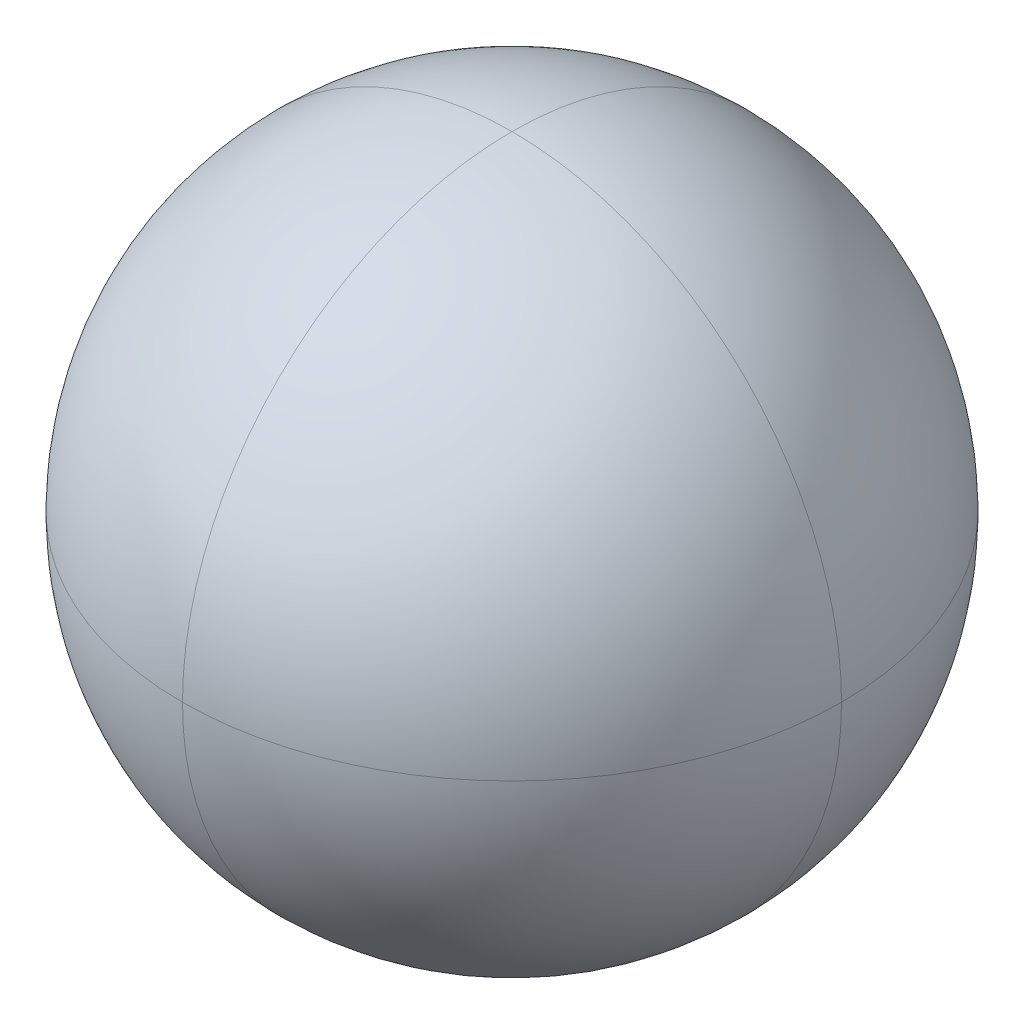
ISO-10303-21;
HEADER;
FILE_DESCRIPTION(('STEP AP214'),'2;1');
FILE_NAME('part.step','',(''),(''),'','','');
FILE_SCHEMA(('AUTOMOTIVE_DESIGN { 1 0 10303 214 1 1 1 1 }'));
ENDSEC;
DATA;
#1=APPLICATION_CONTEXT('core data for automotive mechanical design processes');
#2=APPLICATION_PROTOCOL_DEFINITION('international standard','automotive_design',2000,#1);
#3=PRODUCT_CONTEXT('',#1,'mechanical');
#4=PRODUCT('Part','Part','',(#3));
#5=PRODUCT_RELATED_PRODUCT_CATEGORY('part','',(#4));
#6=PRODUCT_DEFINITION_FORMATION('','',#4);
#7=PRODUCT_DEFINITION_CONTEXT('part definition',#1,'design');
#8=PRODUCT_DEFINITION('design','',#6,#7);
#9=PRODUCT_DEFINITION_SHAPE('','',#8);
#10=(LENGTH_UNIT() NAMED_UNIT(*) SI_UNIT(.MILLI.,.METRE.));
#11=(NAMED_UNIT(*) PLANE_ANGLE_UNIT() SI_UNIT($,.RADIAN.));
#12=(NAMED_UNIT(*) SI_UNIT($,.STERADIAN.) SOLID_ANGLE_UNIT());
#13=UNCERTAINTY_MEASURE_WITH_UNIT(LENGTH_MEASURE(1.E-05),#10,'distance_accuracy_value','');
#14=(GEOMETRIC_REPRESENTATION_CONTEXT(3) GLOBAL_UNCERTAINTY_ASSIGNED_CONTEXT((#13)) GLOBAL_UNIT_ASSIGNED_CONTEXT((#10,
#11,#12)) REPRESENTATION_CONTEXT('',''));
#15=CARTESIAN_POINT('',(0.,0.,0.));
#16=DIRECTION('',(0.,0.,1.));
#17=DIRECTION('',(1.,0.,0.));
#18=AXIS2_PLACEMENT_3D('',#15,#16,#17);
#19=CARTESIAN_POINT('',(0.,20.,0.));
#20=DIRECTION('',(1.,0.,0.));
#21=DIRECTION('',(0.,0.,-1.));
#22=AXIS2_PLACEMENT_3D('',#19,#20,#21);
#23=SPHERICAL_SURFACE('',#22,20.);
#24=CARTESIAN_POINT('',(0.,20.,0.));
#25=DIRECTION('',(1.,0.,0.));
#26=DIRECTION('',(0.,0.,-1.));
#27=AXIS2_PLACEMENT_3D('',#24,#25,#26);
#28=CIRCLE('',#27,20.);
#29=CARTESIAN_POINT('',(0.,20.,20.));
#30=VERTEX_POINT('',#29);
#31=CARTESIAN_POINT('',(0.,40.,0.));
#32=VERTEX_POINT('',#31);
#33=EDGE_CURVE('E90',#30,#32,#28,.F.);
#34=ORIENTED_EDGE('',*,*,#33,.F.);
#35=CARTESIAN_POINT('',(0.,20.,0.));
#36=DIRECTION('',(0.,-1.,0.));
#37=DIRECTION('',(0.,0.,-1.));
#38=AXIS2_PLACEMENT_3D('',#35,#36,#37);
#39=CIRCLE('',#38,20.);
#40=CARTESIAN_POINT('',(20.,20.,0.));
#41=VERTEX_POINT('',#40);
#42=EDGE_CURVE('E11',#41,#30,#39,.T.);
#43=ORIENTED_EDGE('',*,*,#42,.F.);
#44=CARTESIAN_POINT('',(0.,20.,0.));
#45=DIRECTION('',(0.,0.,1.));
#46=DIRECTION('',(1.,0.,0.));
#47=AXIS2_PLACEMENT_3D('',#44,#45,#46);
#48=CIRCLE('',#47,20.);
#49=EDGE_CURVE('E51',#32,#41,#48,.F.);
#50=ORIENTED_EDGE('',*,*,#49,.F.);
#51=EDGE_LOOP('',(#34,#43,#50));
#52=FACE_BOUND('',#51,.T.);
#53=ADVANCED_FACE('F43',(#52),#23,.T.);
#54=CARTESIAN_POINT('',(0.,20.,0.));
#55=DIRECTION('',(0.,0.,1.));
#56=DIRECTION('',(1.,0.,0.));
#57=AXIS2_PLACEMENT_3D('',#54,#55,#56);
#58=SPHERICAL_SURFACE('',#57,20.);
#59=CARTESIAN_POINT('',(0.,20.,0.));
#60=DIRECTION('',(0.,0.,1.));
#61=DIRECTION('',(1.,0.,0.));
#62=AXIS2_PLACEMENT_3D('',#59,#60,#61);
#63=CIRCLE('',#62,20.);
#64=CARTESIAN_POINT('',(0.,0.,0.));
#65=VERTEX_POINT('',#64);
#66=EDGE_CURVE('E84',#41,#65,#63,.F.);
#67=ORIENTED_EDGE('',*,*,#66,.F.);
#68=ORIENTED_EDGE('',*,*,#42,.T.);
#69=CARTESIAN_POINT('',(0.,20.,0.));
#70=DIRECTION('',(1.,0.,0.));
#71=DIRECTION('',(0.,0.,-1.));
#72=AXIS2_PLACEMENT_3D('',#69,#70,#71);
#73=CIRCLE('',#72,20.);
#74=EDGE_CURVE('E80',#65,#30,#73,.F.);
#75=ORIENTED_EDGE('',*,*,#74,.F.);
#76=EDGE_LOOP('',(#67,#68,#75));
#77=FACE_BOUND('',#76,.T.);
#78=ADVANCED_FACE('F128',(#77),#58,.T.);
#79=CARTESIAN_POINT('',(0.,20.,0.));
#80=DIRECTION('',(1.,0.,0.));
#81=DIRECTION('',(0.,0.,-1.));
#82=AXIS2_PLACEMENT_3D('',#79,#80,#81);
#83=SPHERICAL_SURFACE('',#82,20.);
#84=ORIENTED_EDGE('',*,*,#49,.T.);
#85=CARTESIAN_POINT('',(0.,20.,0.));
#86=DIRECTION('',(0.,-1.,0.));
#87=DIRECTION('',(0.,0.,-1.));
#88=AXIS2_PLACEMENT_3D('',#85,#86,#87);
#89=CIRCLE('',#88,20.);
#90=CARTESIAN_POINT('',(0.,20.,-20.));
#91=VERTEX_POINT('',#90);
#92=EDGE_CURVE('E85',#91,#41,#89,.T.);
#93=ORIENTED_EDGE('',*,*,#92,.F.);
#94=CARTESIAN_POINT('',(0.,20.,0.));
#95=DIRECTION('',(1.,0.,0.));
#96=DIRECTION('',(0.,0.,-1.));
#97=AXIS2_PLACEMENT_3D('',#94,#95,#96);
#98=CIRCLE('',#97,20.);
#99=EDGE_CURVE('E96',#32,#91,#98,.F.);
#100=ORIENTED_EDGE('',*,*,#99,.F.);
#101=EDGE_LOOP('',(#84,#93,#100));
#102=FACE_BOUND('',#101,.T.);
#103=ADVANCED_FACE('F126',(#102),#83,.T.);
#104=CARTESIAN_POINT('',(0.,20.,0.));
#105=DIRECTION('',(0.,0.,1.));
#106=DIRECTION('',(1.,0.,0.));
#107=AXIS2_PLACEMENT_3D('',#104,#105,#106);
#108=SPHERICAL_SURFACE('',#107,20.);
#109=CARTESIAN_POINT('',(0.,20.,0.));
#110=DIRECTION('',(0.,1.,0.));
#111=DIRECTION('',(0.,0.,1.));
#112=AXIS2_PLACEMENT_3D('',#109,#110,#111);
#113=CIRCLE('',#112,20.);
#114=CARTESIAN_POINT('',(-20.,20.,0.));
#115=VERTEX_POINT('',#114);
#116=EDGE_CURVE('E74',#115,#30,#113,.T.);
#117=ORIENTED_EDGE('',*,*,#116,.T.);
#118=ORIENTED_EDGE('',*,*,#33,.T.);
#119=CARTESIAN_POINT('',(0.,20.,0.));
#120=DIRECTION('',(0.,0.,1.));
#121=DIRECTION('',(1.,0.,0.));
#122=AXIS2_PLACEMENT_3D('',#119,#120,#121);
#123=CIRCLE('',#122,20.);
#124=EDGE_CURVE('E88',#115,#32,#123,.F.);
#125=ORIENTED_EDGE('',*,*,#124,.F.);
#126=EDGE_LOOP('',(#117,#118,#125));
#127=FACE_BOUND('',#126,.T.);
#128=ADVANCED_FACE('F89',(#127),#108,.T.);
#129=CARTESIAN_POINT('',(0.,20.,0.));
#130=DIRECTION('',(0.,0.,1.));
#131=DIRECTION('',(1.,0.,0.));
#132=AXIS2_PLACEMENT_3D('',#129,#130,#131);
#133=SPHERICAL_SURFACE('',#132,20.);
#134=ORIENTED_EDGE('',*,*,#74,.T.);
#135=ORIENTED_EDGE('',*,*,#116,.F.);
#136=CARTESIAN_POINT('',(0.,20.,0.));
#137=DIRECTION('',(0.,0.,1.));
#138=DIRECTION('',(1.,0.,0.));
#139=AXIS2_PLACEMENT_3D('',#136,#137,#138);
#140=CIRCLE('',#139,20.);
#141=EDGE_CURVE('E78',#65,#115,#140,.F.);
#142=ORIENTED_EDGE('',*,*,#141,.F.);
#143=EDGE_LOOP('',(#134,#135,#142));
#144=FACE_BOUND('',#143,.T.);
#145=ADVANCED_FACE('F76',(#144),#133,.T.);
#146=CARTESIAN_POINT('',(0.,20.,0.));
#147=DIRECTION('',(1.,0.,0.));
#148=DIRECTION('',(0.,0.,-1.));
#149=AXIS2_PLACEMENT_3D('',#146,#147,#148);
#150=SPHERICAL_SURFACE('',#149,20.);
#151=ORIENTED_EDGE('',*,*,#92,.T.);
#152=ORIENTED_EDGE('',*,*,#66,.T.);
#153=CARTESIAN_POINT('',(0.,20.,0.));
#154=DIRECTION('',(1.,0.,0.));
#155=DIRECTION('',(0.,0.,-1.));
#156=AXIS2_PLACEMENT_3D('',#153,#154,#155);
#157=CIRCLE('',#156,20.);
#158=EDGE_CURVE('E103',#91,#65,#157,.F.);
#159=ORIENTED_EDGE('',*,*,#158,.F.);
#160=EDGE_LOOP('',(#151,#152,#159));
#161=FACE_BOUND('',#160,.T.);
#162=ADVANCED_FACE('F141',(#161),#150,.T.);
#163=CARTESIAN_POINT('',(0.,20.,0.));
#164=DIRECTION('',(0.,1.,0.));
#165=DIRECTION('',(-1.,0.,0.));
#166=AXIS2_PLACEMENT_3D('',#163,#164,#165);
#167=SPHERICAL_SURFACE('',#166,20.);
#168=ORIENTED_EDGE('',*,*,#124,.T.);
#169=ORIENTED_EDGE('',*,*,#99,.T.);
#170=CARTESIAN_POINT('',(0.,20.,0.));
#171=DIRECTION('',(0.,1.,0.));
#172=DIRECTION('',(0.,0.,1.));
#173=AXIS2_PLACEMENT_3D('',#170,#171,#172);
#174=CIRCLE('',#173,20.);
#175=EDGE_CURVE('E101',#115,#91,#174,.F.);
#176=ORIENTED_EDGE('',*,*,#175,.F.);
#177=EDGE_LOOP('',(#168,#169,#176));
#178=FACE_BOUND('',#177,.T.);
#179=ADVANCED_FACE('F106',(#178),#167,.T.);
#180=CARTESIAN_POINT('',(0.,20.,0.));
#181=DIRECTION('',(0.,-1.,0.));
#182=DIRECTION('',(0.,0.,-1.));
#183=AXIS2_PLACEMENT_3D('',#180,#181,#182);
#184=SPHERICAL_SURFACE('',#183,20.);
#185=ORIENTED_EDGE('',*,*,#158,.T.);
#186=ORIENTED_EDGE('',*,*,#141,.T.);
#187=ORIENTED_EDGE('',*,*,#175,.T.);
#188=EDGE_LOOP('',(#185,#186,#187));
#189=FACE_BOUND('',#188,.T.);
#190=ADVANCED_FACE('F100',(#189),#184,.T.);
#191=CLOSED_SHELL('',(#53,#78,#103,#128,#145,#162,#179,#190));
#192=MANIFOLD_SOLID_BREP('B2',#191);
#193=ADVANCED_BREP_SHAPE_REPRESENTATION('',(#18,#192),#14);
#194=SHAPE_DEFINITION_REPRESENTATION(#9,#193);
ENDSEC;
END-ISO-10303-21;
